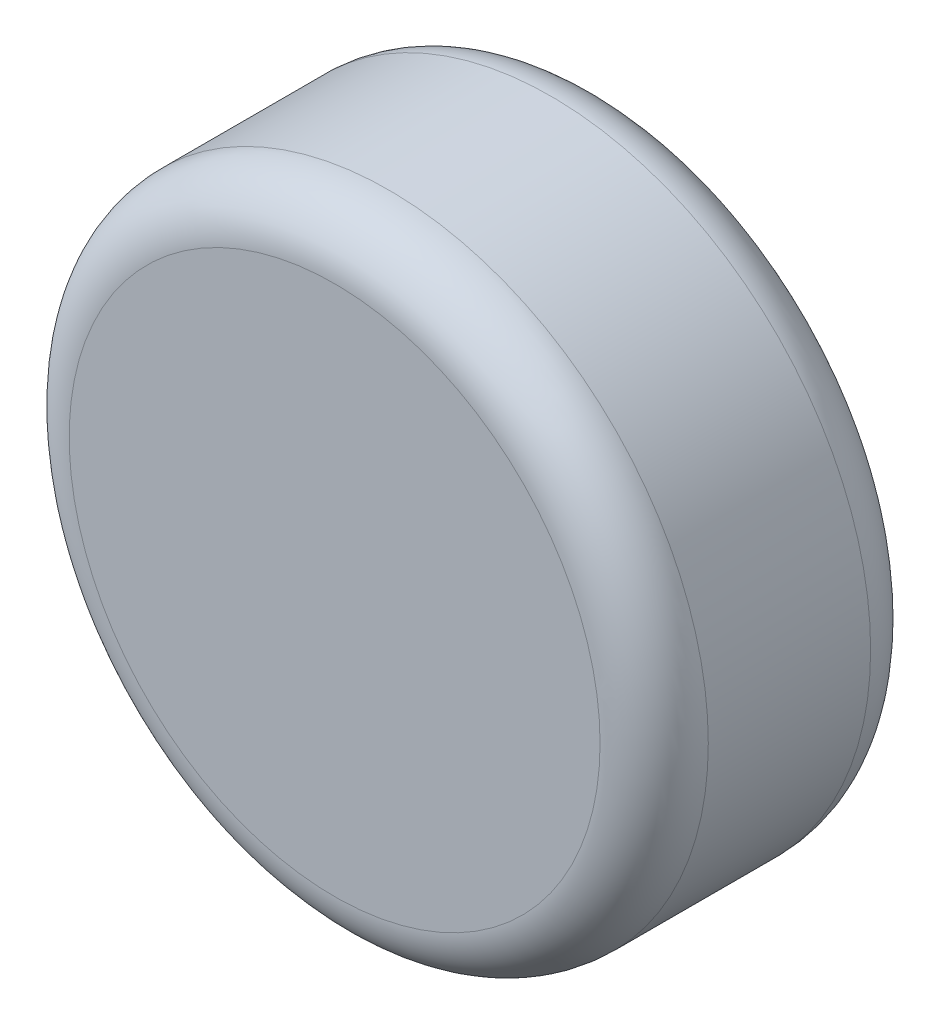
ISO-10303-21;
HEADER;
FILE_DESCRIPTION(('STEP AP214'),'2;1');
FILE_NAME('part.step','',(''),(''),'','','');
FILE_SCHEMA(('AUTOMOTIVE_DESIGN { 1 0 10303 214 1 1 1 1 }'));
ENDSEC;
DATA;
#1=APPLICATION_CONTEXT('core data for automotive mechanical design processes');
#2=APPLICATION_PROTOCOL_DEFINITION('international standard','automotive_design',2000,#1);
#3=PRODUCT_CONTEXT('',#1,'mechanical');
#4=PRODUCT('Part','Part','',(#3));
#5=PRODUCT_RELATED_PRODUCT_CATEGORY('part','',(#4));
#6=PRODUCT_DEFINITION_FORMATION('','',#4);
#7=PRODUCT_DEFINITION_CONTEXT('part definition',#1,'design');
#8=PRODUCT_DEFINITION('design','',#6,#7);
#9=PRODUCT_DEFINITION_SHAPE('','',#8);
#10=(LENGTH_UNIT() NAMED_UNIT(*) SI_UNIT(.MILLI.,.METRE.));
#11=(NAMED_UNIT(*) PLANE_ANGLE_UNIT() SI_UNIT($,.RADIAN.));
#12=(NAMED_UNIT(*) SI_UNIT($,.STERADIAN.) SOLID_ANGLE_UNIT());
#13=UNCERTAINTY_MEASURE_WITH_UNIT(LENGTH_MEASURE(1.E-05),#10,'distance_accuracy_value','');
#14=(GEOMETRIC_REPRESENTATION_CONTEXT(3) GLOBAL_UNCERTAINTY_ASSIGNED_CONTEXT((#13)) GLOBAL_UNIT_ASSIGNED_CONTEXT((#10,
#11,#12)) REPRESENTATION_CONTEXT('',''));
#15=CARTESIAN_POINT('',(0.,0.,0.));
#16=DIRECTION('',(0.,0.,1.));
#17=DIRECTION('',(1.,0.,0.));
#18=AXIS2_PLACEMENT_3D('',#15,#16,#17);
#19=CARTESIAN_POINT('',(63.244345617225,36.6829441000058,-206.805144918771));
#20=DIRECTION('',(0.,0.,-1.));
#21=DIRECTION('',(-1.,0.,0.));
#22=AXIS2_PLACEMENT_3D('',#19,#20,#21);
#23=CYLINDRICAL_SURFACE('',#22,15.);
#24=CARTESIAN_POINT('',(63.244345617225,36.6829441000058,-216.965144918771));
#25=DIRECTION('',(0.,0.,1.));
#26=DIRECTION('',(1.,0.,0.));
#27=AXIS2_PLACEMENT_3D('',#24,#25,#26);
#28=CIRCLE('',#27,15.);
#29=CARTESIAN_POINT('',(78.244345617225,36.6829441000058,-216.965144918771));
#30=VERTEX_POINT('',#29);
#31=EDGE_CURVE('E43',#30,#30,#28,.T.);
#32=ORIENTED_EDGE('',*,*,#31,.T.);
#33=EDGE_LOOP('',(#32));
#34=FACE_BOUND('',#33,.T.);
#35=CARTESIAN_POINT('',(63.244345617225,36.6829441000058,-209.345144918771));
#36=DIRECTION('',(0.,0.,1.));
#37=DIRECTION('',(1.,0.,0.));
#38=AXIS2_PLACEMENT_3D('',#35,#36,#37);
#39=CIRCLE('',#38,15.);
#40=CARTESIAN_POINT('',(78.244345617225,36.6829441000058,-209.345144918771));
#41=VERTEX_POINT('',#40);
#42=EDGE_CURVE('E47',#41,#41,#39,.F.);
#43=ORIENTED_EDGE('',*,*,#42,.T.);
#44=EDGE_LOOP('',(#43));
#45=FACE_BOUND('',#44,.T.);
#46=ADVANCED_FACE('F32',(#34,#45),#23,.T.);
#47=CARTESIAN_POINT('',(63.244345617225,36.6829441000058,-206.805144918771));
#48=DIRECTION('',(0.,0.,1.));
#49=DIRECTION('',(1.,0.,0.));
#50=AXIS2_PLACEMENT_3D('',#47,#48,#49);
#51=PLANE('',#50);
#52=CARTESIAN_POINT('',(63.244345617225,36.6829441000058,-206.805144918771));
#53=DIRECTION('',(0.,0.,1.));
#54=DIRECTION('',(1.,0.,0.));
#55=AXIS2_PLACEMENT_3D('',#52,#53,#54);
#56=CIRCLE('',#55,12.46);
#57=CARTESIAN_POINT('',(75.704345617225,36.6829441000058,-206.805144918771));
#58=VERTEX_POINT('',#57);
#59=EDGE_CURVE('E10',#58,#58,#56,.T.);
#60=ORIENTED_EDGE('',*,*,#59,.T.);
#61=EDGE_LOOP('',(#60));
#62=FACE_BOUND('',#61,.T.);
#63=ADVANCED_FACE('F63',(#62),#51,.T.);
#64=CARTESIAN_POINT('',(63.244345617225,36.6829441000058,-219.505144918771));
#65=DIRECTION('',(0.,0.,1.));
#66=DIRECTION('',(1.,0.,0.));
#67=AXIS2_PLACEMENT_3D('',#64,#65,#66);
#68=PLANE('',#67);
#69=CARTESIAN_POINT('',(63.244345617225,36.6829441000058,-219.505144918771));
#70=DIRECTION('',(0.,0.,1.));
#71=DIRECTION('',(1.,0.,0.));
#72=AXIS2_PLACEMENT_3D('',#69,#70,#71);
#73=CIRCLE('',#72,12.46);
#74=CARTESIAN_POINT('',(75.704345617225,36.6829441000058,-219.505144918771));
#75=VERTEX_POINT('',#74);
#76=EDGE_CURVE('E39',#75,#75,#73,.F.);
#77=ORIENTED_EDGE('',*,*,#76,.T.);
#78=EDGE_LOOP('',(#77));
#79=FACE_BOUND('',#78,.T.);
#80=ADVANCED_FACE('F60',(#79),#68,.F.);
#81=CARTESIAN_POINT('',(63.244345617225,36.6829441000058,-216.965144918771));
#82=DIRECTION('',(0.,0.,1.));
#83=DIRECTION('',(1.,0.,0.));
#84=AXIS2_PLACEMENT_3D('',#81,#82,#83);
#85=TOROIDAL_SURFACE('',#84,12.46,2.54);
#86=ORIENTED_EDGE('',*,*,#76,.F.);
#87=EDGE_LOOP('',(#86));
#88=FACE_BOUND('',#87,.T.);
#89=ORIENTED_EDGE('',*,*,#31,.F.);
#90=EDGE_LOOP('',(#89));
#91=FACE_BOUND('',#90,.T.);
#92=ADVANCED_FACE('F56',(#88,#91),#85,.T.);
#93=CARTESIAN_POINT('',(63.244345617225,36.6829441000058,-209.345144918771));
#94=DIRECTION('',(0.,0.,1.));
#95=DIRECTION('',(1.,0.,0.));
#96=AXIS2_PLACEMENT_3D('',#93,#94,#95);
#97=TOROIDAL_SURFACE('',#96,12.46,2.54);
#98=ORIENTED_EDGE('',*,*,#42,.F.);
#99=EDGE_LOOP('',(#98));
#100=FACE_BOUND('',#99,.T.);
#101=ORIENTED_EDGE('',*,*,#59,.F.);
#102=EDGE_LOOP('',(#101));
#103=FACE_BOUND('',#102,.T.);
#104=ADVANCED_FACE('F34',(#100,#103),#97,.T.);
#105=CLOSED_SHELL('',(#46,#63,#80,#92,#104));
#106=MANIFOLD_SOLID_BREP('B2',#105);
#107=ADVANCED_BREP_SHAPE_REPRESENTATION('',(#18,#106),#14);
#108=SHAPE_DEFINITION_REPRESENTATION(#9,#107);
ENDSEC;
END-ISO-10303-21;
